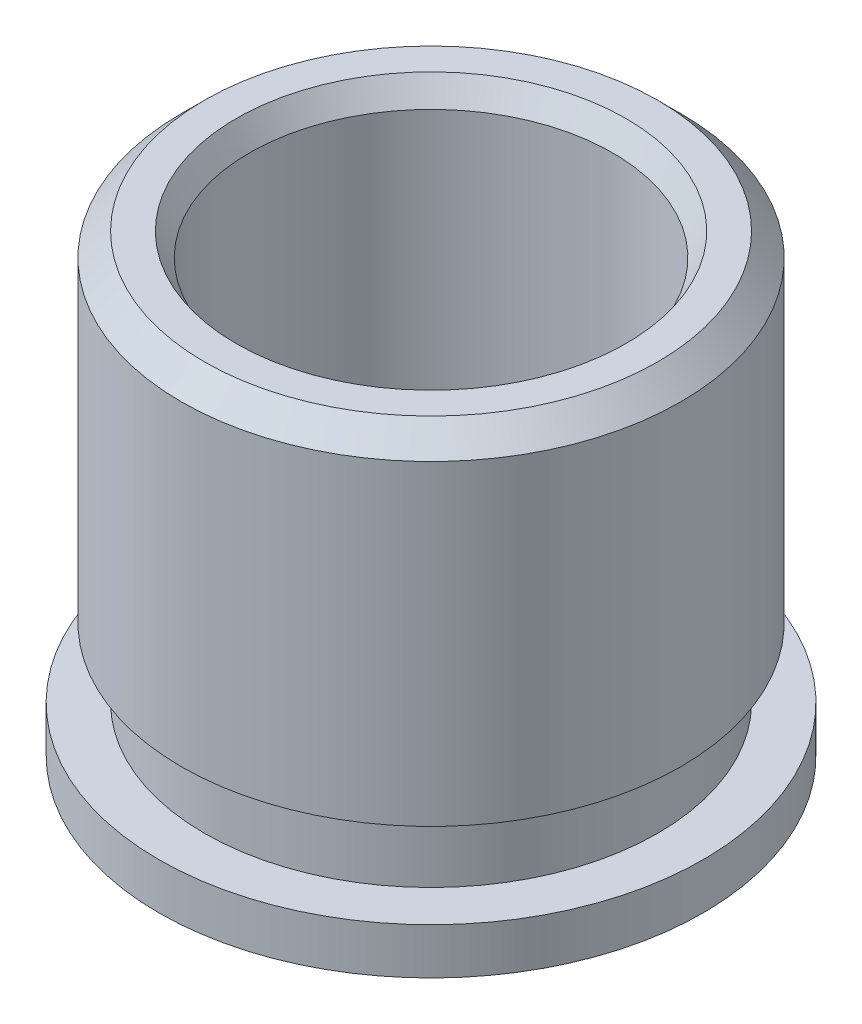
ISO-10303-21;
HEADER;
FILE_DESCRIPTION(('STEP AP214'),'2;1');
FILE_NAME('part.step','',(''),(''),'','','');
FILE_SCHEMA(('AUTOMOTIVE_DESIGN { 1 0 10303 214 1 1 1 1 }'));
ENDSEC;
DATA;
#1=APPLICATION_CONTEXT('core data for automotive mechanical design processes');
#2=APPLICATION_PROTOCOL_DEFINITION('international standard','automotive_design',2000,#1);
#3=PRODUCT_CONTEXT('',#1,'mechanical');
#4=PRODUCT('Part','Part','',(#3));
#5=PRODUCT_RELATED_PRODUCT_CATEGORY('part','',(#4));
#6=PRODUCT_DEFINITION_FORMATION('','',#4);
#7=PRODUCT_DEFINITION_CONTEXT('part definition',#1,'design');
#8=PRODUCT_DEFINITION('design','',#6,#7);
#9=PRODUCT_DEFINITION_SHAPE('','',#8);
#10=(LENGTH_UNIT() NAMED_UNIT(*) SI_UNIT(.MILLI.,.METRE.));
#11=(NAMED_UNIT(*) PLANE_ANGLE_UNIT() SI_UNIT($,.RADIAN.));
#12=(NAMED_UNIT(*) SI_UNIT($,.STERADIAN.) SOLID_ANGLE_UNIT());
#13=UNCERTAINTY_MEASURE_WITH_UNIT(LENGTH_MEASURE(1.E-05),#10,'distance_accuracy_value','');
#14=(GEOMETRIC_REPRESENTATION_CONTEXT(3) GLOBAL_UNCERTAINTY_ASSIGNED_CONTEXT((#13)) GLOBAL_UNIT_ASSIGNED_CONTEXT((#10,
#11,#12)) REPRESENTATION_CONTEXT('',''));
#15=CARTESIAN_POINT('',(0.,0.,0.));
#16=DIRECTION('',(0.,0.,1.));
#17=DIRECTION('',(1.,0.,0.));
#18=AXIS2_PLACEMENT_3D('',#15,#16,#17);
#19=CARTESIAN_POINT('',(0.,2.5019,0.));
#20=DIRECTION('',(0.,1.,0.));
#21=DIRECTION('',(0.,0.,1.));
#22=AXIS2_PLACEMENT_3D('',#19,#20,#21);
#23=CYLINDRICAL_SURFACE('',#22,2.9972);
#24=CARTESIAN_POINT('',(0.,-2.5019,0.));
#25=DIRECTION('',(0.,1.,0.));
#26=DIRECTION('',(0.,0.,1.));
#27=AXIS2_PLACEMENT_3D('',#24,#25,#26);
#28=CIRCLE('',#27,2.9972);
#29=CARTESIAN_POINT('',(0.,-2.5019,2.9972));
#30=VERTEX_POINT('',#29);
#31=EDGE_CURVE('E71',#30,#30,#28,.T.);
#32=ORIENTED_EDGE('',*,*,#31,.T.);
#33=EDGE_LOOP('',(#32));
#34=FACE_BOUND('',#33,.T.);
#35=CARTESIAN_POINT('',(0.,-1.9939,0.));
#36=DIRECTION('',(0.,1.,0.));
#37=DIRECTION('',(0.,0.,1.));
#38=AXIS2_PLACEMENT_3D('',#35,#36,#37);
#39=CIRCLE('',#38,2.9972);
#40=CARTESIAN_POINT('',(0.,-1.9939,2.9972));
#41=VERTEX_POINT('',#40);
#42=EDGE_CURVE('E10',#41,#41,#39,.T.);
#43=ORIENTED_EDGE('',*,*,#42,.F.);
#44=EDGE_LOOP('',(#43));
#45=FACE_BOUND('',#44,.T.);
#46=ADVANCED_FACE('F34',(#34,#45),#23,.T.);
#47=CARTESIAN_POINT('',(0.,-1.9939,0.));
#48=DIRECTION('',(0.,1.,0.));
#49=DIRECTION('',(0.,0.,1.));
#50=AXIS2_PLACEMENT_3D('',#47,#48,#49);
#51=PLANE('',#50);
#52=ORIENTED_EDGE('',*,*,#42,.T.);
#53=EDGE_LOOP('',(#52));
#54=FACE_BOUND('',#53,.T.);
#55=CARTESIAN_POINT('',(0.,-1.9939,0.));
#56=DIRECTION('',(0.,1.,0.));
#57=DIRECTION('',(0.,0.,1.));
#58=AXIS2_PLACEMENT_3D('',#55,#56,#57);
#59=CIRCLE('',#58,2.49555);
#60=CARTESIAN_POINT('',(0.,-1.9939,2.49555));
#61=VERTEX_POINT('',#60);
#62=EDGE_CURVE('E40',#61,#61,#59,.T.);
#63=ORIENTED_EDGE('',*,*,#62,.F.);
#64=EDGE_LOOP('',(#63));
#65=FACE_BOUND('',#64,.T.);
#66=ADVANCED_FACE('F95',(#54,#65),#51,.T.);
#67=CARTESIAN_POINT('',(0.,2.5019,0.));
#68=DIRECTION('',(0.,1.,0.));
#69=DIRECTION('',(0.,0.,1.));
#70=AXIS2_PLACEMENT_3D('',#67,#68,#69);
#71=CYLINDRICAL_SURFACE('',#70,2.49555);
#72=ORIENTED_EDGE('',*,*,#62,.T.);
#73=EDGE_LOOP('',(#72));
#74=FACE_BOUND('',#73,.T.);
#75=CARTESIAN_POINT('',(0.,-1.2319,0.));
#76=DIRECTION('',(0.,1.,0.));
#77=DIRECTION('',(0.,0.,1.));
#78=AXIS2_PLACEMENT_3D('',#75,#76,#77);
#79=CIRCLE('',#78,2.49555);
#80=CARTESIAN_POINT('',(0.,-1.2319,2.49555));
#81=VERTEX_POINT('',#80);
#82=EDGE_CURVE('E44',#81,#81,#79,.T.);
#83=ORIENTED_EDGE('',*,*,#82,.F.);
#84=EDGE_LOOP('',(#83));
#85=FACE_BOUND('',#84,.T.);
#86=ADVANCED_FACE('F99',(#74,#85),#71,.T.);
#87=CARTESIAN_POINT('',(0.,-1.2319,0.));
#88=DIRECTION('',(0.,-1.,0.));
#89=DIRECTION('',(0.,0.,-1.));
#90=AXIS2_PLACEMENT_3D('',#87,#88,#89);
#91=PLANE('',#90);
#92=ORIENTED_EDGE('',*,*,#82,.T.);
#93=EDGE_LOOP('',(#92));
#94=FACE_BOUND('',#93,.T.);
#95=CARTESIAN_POINT('',(0.,-1.2319,0.));
#96=DIRECTION('',(0.,1.,0.));
#97=DIRECTION('',(0.,0.,1.));
#98=AXIS2_PLACEMENT_3D('',#95,#96,#97);
#99=CIRCLE('',#98,2.74955);
#100=CARTESIAN_POINT('',(0.,-1.2319,2.74955));
#101=VERTEX_POINT('',#100);
#102=EDGE_CURVE('E48',#101,#101,#99,.T.);
#103=ORIENTED_EDGE('',*,*,#102,.F.);
#104=EDGE_LOOP('',(#103));
#105=FACE_BOUND('',#104,.T.);
#106=ADVANCED_FACE('F103',(#94,#105),#91,.T.);
#107=CARTESIAN_POINT('',(0.,2.5019,0.));
#108=DIRECTION('',(0.,1.,0.));
#109=DIRECTION('',(0.,0.,1.));
#110=AXIS2_PLACEMENT_3D('',#107,#108,#109);
#111=CYLINDRICAL_SURFACE('',#110,2.74955);
#112=ORIENTED_EDGE('',*,*,#102,.T.);
#113=EDGE_LOOP('',(#112));
#114=FACE_BOUND('',#113,.T.);
#115=CARTESIAN_POINT('',(0.,2.2479,0.));
#116=DIRECTION('',(0.,1.,0.));
#117=DIRECTION('',(0.,0.,1.));
#118=AXIS2_PLACEMENT_3D('',#115,#116,#117);
#119=CIRCLE('',#118,2.74955);
#120=CARTESIAN_POINT('',(0.,2.2479,2.74955));
#121=VERTEX_POINT('',#120);
#122=EDGE_CURVE('E53',#121,#121,#119,.T.);
#123=ORIENTED_EDGE('',*,*,#122,.F.);
#124=EDGE_LOOP('',(#123));
#125=FACE_BOUND('',#124,.T.);
#126=ADVANCED_FACE('F109',(#114,#125),#111,.T.);
#127=CARTESIAN_POINT('',(0.,2.5019,0.));
#128=DIRECTION('',(0.,-1.,0.));
#129=DIRECTION('',(0.,0.,-1.));
#130=AXIS2_PLACEMENT_3D('',#127,#128,#129);
#131=CONICAL_SURFACE('',#130,2.49555,0.785398163397447);
#132=ORIENTED_EDGE('',*,*,#122,.T.);
#133=EDGE_LOOP('',(#132));
#134=FACE_BOUND('',#133,.T.);
#135=CARTESIAN_POINT('',(0.,2.5019,0.));
#136=DIRECTION('',(0.,1.,0.));
#137=DIRECTION('',(0.,0.,1.));
#138=AXIS2_PLACEMENT_3D('',#135,#136,#137);
#139=CIRCLE('',#138,2.49555);
#140=CARTESIAN_POINT('',(0.,2.5019,2.49555));
#141=VERTEX_POINT('',#140);
#142=EDGE_CURVE('E56',#141,#141,#139,.T.);
#143=ORIENTED_EDGE('',*,*,#142,.F.);
#144=EDGE_LOOP('',(#143));
#145=FACE_BOUND('',#144,.T.);
#146=ADVANCED_FACE('F113',(#134,#145),#131,.T.);
#147=CARTESIAN_POINT('',(0.,2.5019,0.));
#148=DIRECTION('',(0.,1.,0.));
#149=DIRECTION('',(0.,0.,1.));
#150=AXIS2_PLACEMENT_3D('',#147,#148,#149);
#151=PLANE('',#150);
#152=ORIENTED_EDGE('',*,*,#142,.T.);
#153=EDGE_LOOP('',(#152));
#154=FACE_BOUND('',#153,.T.);
#155=CARTESIAN_POINT('',(0.,2.5019,0.));
#156=DIRECTION('',(0.,1.,0.));
#157=DIRECTION('',(0.,0.,1.));
#158=AXIS2_PLACEMENT_3D('',#155,#156,#157);
#159=CIRCLE('',#158,2.14664696837416);
#160=CARTESIAN_POINT('',(0.,2.5019,2.14664696837416));
#161=VERTEX_POINT('',#160);
#162=EDGE_CURVE('E59',#161,#161,#159,.T.);
#163=ORIENTED_EDGE('',*,*,#162,.F.);
#164=EDGE_LOOP('',(#163));
#165=FACE_BOUND('',#164,.T.);
#166=ADVANCED_FACE('F117',(#154,#165),#151,.T.);
#167=CARTESIAN_POINT('',(0.,2.2479,0.));
#168=DIRECTION('',(0.,1.,0.));
#169=DIRECTION('',(0.,0.,1.));
#170=AXIS2_PLACEMENT_3D('',#167,#168,#169);
#171=CONICAL_SURFACE('',#170,2.,0.523598775598299);
#172=ORIENTED_EDGE('',*,*,#162,.T.);
#173=EDGE_LOOP('',(#172));
#174=FACE_BOUND('',#173,.T.);
#175=CARTESIAN_POINT('',(0.,2.2479,0.));
#176=DIRECTION('',(0.,1.,0.));
#177=DIRECTION('',(0.,0.,1.));
#178=AXIS2_PLACEMENT_3D('',#175,#176,#177);
#179=CIRCLE('',#178,2.);
#180=CARTESIAN_POINT('',(0.,2.2479,2.));
#181=VERTEX_POINT('',#180);
#182=EDGE_CURVE('E62',#181,#181,#179,.T.);
#183=ORIENTED_EDGE('',*,*,#182,.F.);
#184=EDGE_LOOP('',(#183));
#185=FACE_BOUND('',#184,.T.);
#186=ADVANCED_FACE('F91',(#174,#185),#171,.F.);
#187=CARTESIAN_POINT('',(0.,2.5019,0.));
#188=DIRECTION('',(0.,1.,0.));
#189=DIRECTION('',(0.,0.,1.));
#190=AXIS2_PLACEMENT_3D('',#187,#188,#189);
#191=CYLINDRICAL_SURFACE('',#190,2.);
#192=ORIENTED_EDGE('',*,*,#182,.T.);
#193=EDGE_LOOP('',(#192));
#194=FACE_BOUND('',#193,.T.);
#195=CARTESIAN_POINT('',(0.,-2.2479,0.));
#196=DIRECTION('',(0.,1.,0.));
#197=DIRECTION('',(0.,0.,1.));
#198=AXIS2_PLACEMENT_3D('',#195,#196,#197);
#199=CIRCLE('',#198,2.);
#200=CARTESIAN_POINT('',(0.,-2.2479,2.));
#201=VERTEX_POINT('',#200);
#202=EDGE_CURVE('E65',#201,#201,#199,.T.);
#203=ORIENTED_EDGE('',*,*,#202,.F.);
#204=EDGE_LOOP('',(#203));
#205=FACE_BOUND('',#204,.T.);
#206=ADVANCED_FACE('F85',(#194,#205),#191,.F.);
#207=CARTESIAN_POINT('',(0.,-2.5019,0.));
#208=DIRECTION('',(0.,-1.,0.));
#209=DIRECTION('',(0.,0.,-1.));
#210=AXIS2_PLACEMENT_3D('',#207,#208,#209);
#211=CONICAL_SURFACE('',#210,2.14664696837416,0.523598775598299);
#212=ORIENTED_EDGE('',*,*,#202,.T.);
#213=EDGE_LOOP('',(#212));
#214=FACE_BOUND('',#213,.T.);
#215=CARTESIAN_POINT('',(0.,-2.5019,0.));
#216=DIRECTION('',(0.,1.,0.));
#217=DIRECTION('',(0.,0.,1.));
#218=AXIS2_PLACEMENT_3D('',#215,#216,#217);
#219=CIRCLE('',#218,2.14664696837416);
#220=CARTESIAN_POINT('',(0.,-2.5019,2.14664696837416));
#221=VERTEX_POINT('',#220);
#222=EDGE_CURVE('E68',#221,#221,#219,.T.);
#223=ORIENTED_EDGE('',*,*,#222,.F.);
#224=EDGE_LOOP('',(#223));
#225=FACE_BOUND('',#224,.T.);
#226=ADVANCED_FACE('F80',(#214,#225),#211,.F.);
#227=CARTESIAN_POINT('',(0.,-2.5019,0.));
#228=DIRECTION('',(0.,1.,0.));
#229=DIRECTION('',(0.,0.,1.));
#230=AXIS2_PLACEMENT_3D('',#227,#228,#229);
#231=PLANE('',#230);
#232=ORIENTED_EDGE('',*,*,#31,.F.);
#233=EDGE_LOOP('',(#232));
#234=FACE_BOUND('',#233,.T.);
#235=ORIENTED_EDGE('',*,*,#222,.T.);
#236=EDGE_LOOP('',(#235));
#237=FACE_BOUND('',#236,.T.);
#238=ADVANCED_FACE('F77',(#234,#237),#231,.F.);
#239=CLOSED_SHELL('',(#46,#66,#86,#106,#126,#146,#166,#186,#206,#226,#238));
#240=MANIFOLD_SOLID_BREP('B2',#239);
#241=ADVANCED_BREP_SHAPE_REPRESENTATION('',(#18,#240),#14);
#242=SHAPE_DEFINITION_REPRESENTATION(#9,#241);
ENDSEC;
END-ISO-10303-21;
